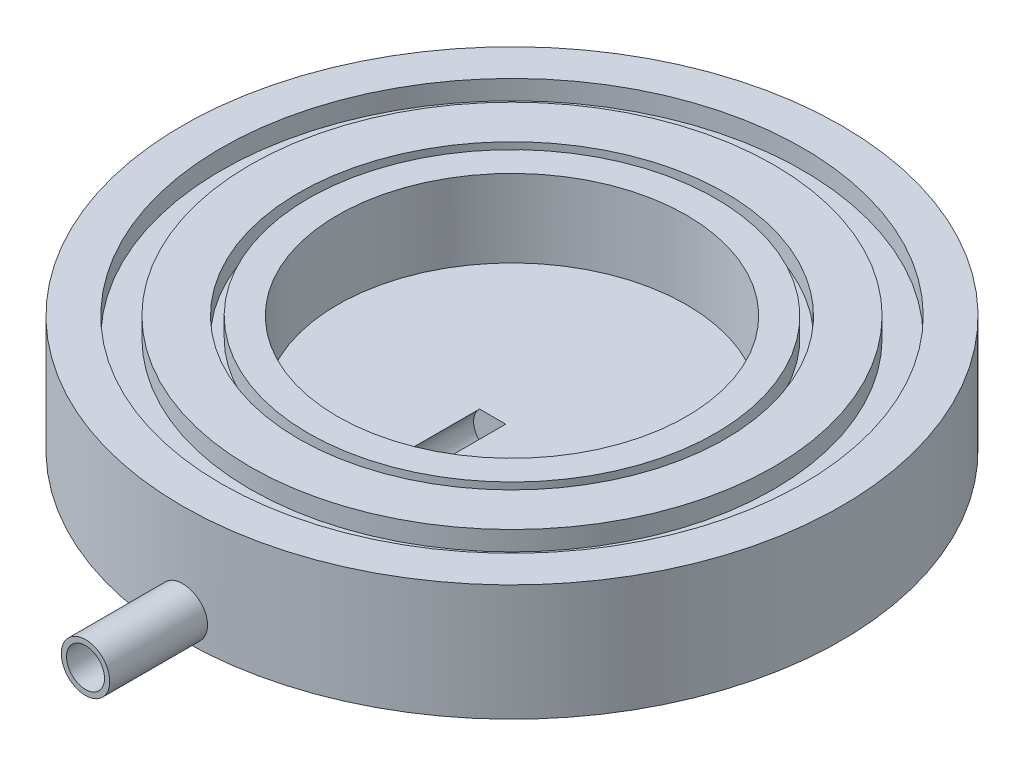
ISO-10303-21;
HEADER;
FILE_DESCRIPTION(('STEP AP214'),'2;1');
FILE_NAME('part.step','',(''),(''),'','','');
FILE_SCHEMA(('AUTOMOTIVE_DESIGN { 1 0 10303 214 1 1 1 1 }'));
ENDSEC;
DATA;
#1=APPLICATION_CONTEXT('core data for automotive mechanical design processes');
#2=APPLICATION_PROTOCOL_DEFINITION('international standard','automotive_design',2000,#1);
#3=PRODUCT_CONTEXT('',#1,'mechanical');
#4=PRODUCT('Part','Part','',(#3));
#5=PRODUCT_RELATED_PRODUCT_CATEGORY('part','',(#4));
#6=PRODUCT_DEFINITION_FORMATION('','',#4);
#7=PRODUCT_DEFINITION_CONTEXT('part definition',#1,'design');
#8=PRODUCT_DEFINITION('design','',#6,#7);
#9=PRODUCT_DEFINITION_SHAPE('','',#8);
#10=(LENGTH_UNIT() NAMED_UNIT(*) SI_UNIT(.MILLI.,.METRE.));
#11=(NAMED_UNIT(*) PLANE_ANGLE_UNIT() SI_UNIT($,.RADIAN.));
#12=(NAMED_UNIT(*) SI_UNIT($,.STERADIAN.) SOLID_ANGLE_UNIT());
#13=UNCERTAINTY_MEASURE_WITH_UNIT(LENGTH_MEASURE(1.E-05),#10,'distance_accuracy_value','');
#14=(GEOMETRIC_REPRESENTATION_CONTEXT(3) GLOBAL_UNCERTAINTY_ASSIGNED_CONTEXT((#13)) GLOBAL_UNIT_ASSIGNED_CONTEXT((#10,
#11,#12)) REPRESENTATION_CONTEXT('',''));
#15=CARTESIAN_POINT('',(0.,0.,0.));
#16=DIRECTION('',(0.,0.,1.));
#17=DIRECTION('',(1.,0.,0.));
#18=AXIS2_PLACEMENT_3D('',#15,#16,#17);
#19=CARTESIAN_POINT('',(0.,6.,0.));
#20=DIRECTION('',(0.,-1.,0.));
#21=DIRECTION('',(0.,0.,-1.));
#22=AXIS2_PLACEMENT_3D('',#19,#20,#21);
#23=CYLINDRICAL_SURFACE('',#22,17.);
#24=CARTESIAN_POINT('',(0.,6.,0.));
#25=DIRECTION('',(0.,1.,0.));
#26=DIRECTION('',(0.,0.,1.));
#27=AXIS2_PLACEMENT_3D('',#24,#25,#26);
#28=CIRCLE('',#27,17.);
#29=CARTESIAN_POINT('',(0.,6.,17.));
#30=VERTEX_POINT('',#29);
#31=EDGE_CURVE('E106',#30,#30,#28,.T.);
#32=ORIENTED_EDGE('',*,*,#31,.F.);
#33=EDGE_LOOP('',(#32));
#34=FACE_BOUND('',#33,.T.);
#35=CARTESIAN_POINT('',(0.,0.,0.));
#36=DIRECTION('',(0.,1.,0.));
#37=DIRECTION('',(0.,0.,1.));
#38=AXIS2_PLACEMENT_3D('',#35,#36,#37);
#39=CIRCLE('',#38,17.);
#40=CARTESIAN_POINT('',(0.,0.,17.));
#41=VERTEX_POINT('',#40);
#42=EDGE_CURVE('E165',#41,#41,#39,.T.);
#43=ORIENTED_EDGE('',*,*,#42,.T.);
#44=EDGE_LOOP('',(#43));
#45=FACE_BOUND('',#44,.T.);
#46=CARTESIAN_POINT('',(-1.25,1.28902222178879,16.953981833186));
#47=CARTESIAN_POINT('',(-1.24999692557943,1.21891107328766,16.9539824459439));
#48=CARTESIAN_POINT('',(-1.24408147886689,1.14875150469129,16.9544214169413));
#49=CARTESIAN_POINT('',(-1.22056959678384,1.01037159336078,16.9561299662255));
#50=CARTESIAN_POINT('',(-1.20295974332161,0.94215357222219,16.9574004986165));
#51=CARTESIAN_POINT('',(-1.1565693287629,0.809681114872543,16.9606274888907));
#52=CARTESIAN_POINT('',(-1.12779487966738,0.745424532258821,16.9625835714164));
#53=CARTESIAN_POINT('',(-1.05990246372912,0.622669361280807,16.9669607865146));
#54=CARTESIAN_POINT('',(-1.02078678762389,0.564169501648953,16.9693818160618));
#55=CARTESIAN_POINT('',(-0.933236050581498,0.454453651005182,16.9744216645957));
#56=CARTESIAN_POINT('',(-0.884784387666699,0.403250922791576,16.9770408308078));
#57=CARTESIAN_POINT('',(-0.77997183433928,0.309696547084535,16.9821786349764));
#58=CARTESIAN_POINT('',(-0.723610606541612,0.267345277344849,16.9846972686387));
#59=CARTESIAN_POINT('',(-0.604501502849747,0.192653314335197,16.9893533909041));
#60=CARTESIAN_POINT('',(-0.541746546947161,0.160323882262436,16.9914904496098));
#61=CARTESIAN_POINT('',(-0.411680884364776,0.106665362228291,16.995138923341));
#62=CARTESIAN_POINT('',(-0.34437024174164,0.0853361196316241,16.9966503471614));
#63=CARTESIAN_POINT('',(-0.207234151380024,0.0543210269826913,16.9988748380483));
#64=CARTESIAN_POINT('',(-0.137413515867867,0.0446140049775358,16.9995893566571));
#65=CARTESIAN_POINT('',(0.00286947837938254,0.0370534834948896,17.0001444349776));
#66=CARTESIAN_POINT('',(0.0733318275417687,0.0391998074843859,16.9999850077051));
#67=CARTESIAN_POINT('',(0.212754602923519,0.0552676648202849,16.9988113616705));
#68=CARTESIAN_POINT('',(0.281717669127896,0.0691664281904222,16.9977987958507));
#69=CARTESIAN_POINT('',(0.416329354257501,0.108309259207814,16.9950347187855));
#70=CARTESIAN_POINT('',(0.481977947625944,0.133553414320712,16.9932832018434));
#71=CARTESIAN_POINT('',(0.608169949666979,0.194696023768112,16.9892355037306));
#72=CARTESIAN_POINT('',(0.668708370137764,0.230604737138619,16.9869387985317));
#73=CARTESIAN_POINT('',(0.782907106281559,0.312049692553388,16.9820590158151));
#74=CARTESIAN_POINT('',(0.836567313828863,0.357586085915253,16.9794759337968));
#75=CARTESIAN_POINT('',(0.935619422857147,0.457122258845775,16.9743066862842));
#76=CARTESIAN_POINT('',(0.980991456077992,0.511141812773049,16.9717205279598));
#77=CARTESIAN_POINT('',(1.06202593177972,0.626041793349669,16.9668427880922));
#78=CARTESIAN_POINT('',(1.09768836858724,0.686922224007822,16.9645512067212));
#79=CARTESIAN_POINT('',(1.15829023695906,0.813829069430998,16.9605215350158));
#80=CARTESIAN_POINT('',(1.1832287358139,0.879855931214736,16.9587834928288));
#81=CARTESIAN_POINT('',(1.2216606099829,1.01517516367991,16.9560584976914));
#82=CARTESIAN_POINT('',(1.23515417208654,1.08446748104732,16.955071532483));
#83=CARTESIAN_POINT('',(1.25028819040206,1.22417709322212,16.9539623118694));
#84=CARTESIAN_POINT('',(1.25195630832877,1.29459137624736,16.9538380384963));
#85=CARTESIAN_POINT('',(1.24346445207439,1.43469865751284,16.9544629398325));
#86=CARTESIAN_POINT('',(1.23330456347258,1.50439166096808,16.9552121082222));
#87=CARTESIAN_POINT('',(1.2014681149111,1.64099924676947,16.9574976332766));
#88=CARTESIAN_POINT('',(1.17980437827177,1.70791683350052,16.9590331133732));
#89=CARTESIAN_POINT('',(1.12558819868433,1.8371669402595,16.9627175058434));
#90=CARTESIAN_POINT('',(1.093035619262,1.8994994028083,16.9648664259054));
#91=CARTESIAN_POINT('',(1.01789545578617,2.01793669867594,16.9695404494383));
#92=CARTESIAN_POINT('',(0.975289387016896,2.07402977711389,16.9720662426589));
#93=CARTESIAN_POINT('',(0.881278475070118,2.17827742166938,16.9772070305212));
#94=CARTESIAN_POINT('',(0.829873513620272,2.22643188106106,16.9798220263615));
#95=CARTESIAN_POINT('',(0.719604721600593,2.31352928256047,16.9848525221661));
#96=CARTESIAN_POINT('',(0.660726703661309,2.35245428877407,16.9872676278468));
#97=CARTESIAN_POINT('',(0.53725414463098,2.41986495234523,16.9916205512693));
#98=CARTESIAN_POINT('',(0.472659649697932,2.44835069398566,16.9935583728645));
#99=CARTESIAN_POINT('',(0.339652849576902,2.49404321795917,16.9967365422323));
#100=CARTESIAN_POINT('',(0.271244416979004,2.51126122285975,16.997977583816));
#101=CARTESIAN_POINT('',(0.132498128775221,2.53396622097393,16.9996251545688));
#102=CARTESIAN_POINT('',(0.0621603008194301,2.53945338221295,17.0000316956906));
#103=CARTESIAN_POINT('',(-0.0782709964115803,2.53853915532199,16.9999644877124));
#104=CARTESIAN_POINT('',(-0.148364650740278,2.53216577726998,16.9994928126234));
#105=CARTESIAN_POINT('',(-0.286483454965149,2.50776963159518,16.9977262960799));
#106=CARTESIAN_POINT('',(-0.354508601588181,2.48974684553976,16.9964314533231));
#107=CARTESIAN_POINT('',(-0.486562361031647,2.4425702321723,16.9931640081651));
#108=CARTESIAN_POINT('',(-0.550591089402136,2.41341672686086,16.9911914253706));
#109=CARTESIAN_POINT('',(-0.672849362079839,2.34480969574453,16.9867895838645));
#110=CARTESIAN_POINT('',(-0.73107902762517,2.305356385335,16.9843603347032));
#111=CARTESIAN_POINT('',(-0.840229174830547,2.21716499520072,16.9793112950387));
#112=CARTESIAN_POINT('',(-0.891133024700776,2.16840635520631,16.976691090694));
#113=CARTESIAN_POINT('',(-0.984052685816107,2.06302205799333,16.9715589165542));
#114=CARTESIAN_POINT('',(-1.02606633043069,2.00639448859716,16.9690469732619));
#115=CARTESIAN_POINT('',(-1.10005662020513,1.88679299546481,16.9644114596226));
#116=CARTESIAN_POINT('',(-1.13201761308658,1.82380937457393,16.9622884970546));
#117=CARTESIAN_POINT('',(-1.18487080340908,1.69339857157662,16.9586788843558));
#118=CARTESIAN_POINT('',(-1.20577584741143,1.62597664952791,16.9571914961015));
#119=CARTESIAN_POINT('',(-1.23054404650428,1.51329484493451,16.9554076662488));
#120=CARTESIAN_POINT('',(-1.23783046484604,1.46876160446744,16.9548754018856));
#121=CARTESIAN_POINT('',(-1.24755942517235,1.37916632247737,16.9541622887026));
#122=CARTESIAN_POINT('',(-1.25000197687838,1.33410428201584,16.9539814391774));
#123=CARTESIAN_POINT('',(-1.25,1.28902222178879,16.953981833186));
#124=B_SPLINE_CURVE_WITH_KNOTS('',3,(#46,#47,#48,#49,#50,#51,#52,#53,#54,#55,#56,#57,#58,#59,
#60,#61,#62,#63,#64,#65,#66,#67,#68,#69,#70,#71,#72,#73,#74,#75,#76,#77,#78,#79,#80,#81,#82,#83,
#84,#85,#86,#87,#88,#89,#90,#91,#92,#93,#94,#95,#96,#97,#98,#99,#100,#101,#102,#103,#104,#105,
#106,#107,#108,#109,#110,#111,#112,#113,#114,#115,#116,#117,#118,#119,#120,#121,#122,#123),
.UNSPECIFIED.,.T.,.F.,(4,2,2,2,2,2,2,2,2,2,2,2,2,2,2,2,2,2,2,2,2,2,2,2,2,2,2,2,2,2,2,2,2,2,2,2,
2,2,4),(0.,0.210168855610384,0.420579275311207,0.630874669053931,0.841123518174783,
1.05174975741825,1.26238498372439,1.47325604282224,1.6841241375171,1.89460751095823,
2.10508774965884,2.3151611215402,2.52523611297935,2.7355138494702,2.94579489112785,
3.15657358259459,3.36735239721981,3.57814954052707,3.78894324340928,3.9992437009626,
4.20954263693657,4.41960764361068,4.62967528321187,4.84013221258036,5.05059197107628,
5.26145743081057,5.47232118805581,5.68297460590195,5.89362500645725,6.10377856217503,
6.31393245041587,6.52408025957501,6.73422367435593,6.94483689552288,7.15550138623813,
7.36649228241753,7.57723747413227,7.71237809334555,7.84751844133634),.UNSPECIFIED.);
#125=CARTESIAN_POINT('',(-1.25,1.28902222178879,16.953981833186));
#126=VERTEX_POINT('',#125);
#127=EDGE_CURVE('E50',#126,#126,#124,.T.);
#128=ORIENTED_EDGE('',*,*,#127,.F.);
#129=EDGE_LOOP('',(#128));
#130=FACE_BOUND('',#129,.T.);
#131=ADVANCED_FACE('F41',(#34,#45,#130),#23,.T.);
#132=CARTESIAN_POINT('',(0.,2.,0.));
#133=DIRECTION('',(0.,1.,0.));
#134=DIRECTION('',(0.,0.,1.));
#135=AXIS2_PLACEMENT_3D('',#132,#133,#134);
#136=CYLINDRICAL_SURFACE('',#135,9.);
#137=CARTESIAN_POINT('',(0.,6.,0.));
#138=DIRECTION('',(0.,1.,0.));
#139=DIRECTION('',(0.,0.,1.));
#140=AXIS2_PLACEMENT_3D('',#137,#138,#139);
#141=CIRCLE('',#140,9.);
#142=CARTESIAN_POINT('',(0.,6.,9.));
#143=VERTEX_POINT('',#142);
#144=EDGE_CURVE('E88',#143,#143,#141,.T.);
#145=ORIENTED_EDGE('',*,*,#144,.T.);
#146=EDGE_LOOP('',(#145));
#147=FACE_BOUND('',#146,.T.);
#148=CARTESIAN_POINT('',(0.,2.,0.));
#149=DIRECTION('',(0.,1.,0.));
#150=DIRECTION('',(0.,0.,1.));
#151=AXIS2_PLACEMENT_3D('',#148,#149,#150);
#152=CIRCLE('',#151,9.);
#153=CARTESIAN_POINT('',(0.67636058871575,2.,8.97454936774165));
#154=VERTEX_POINT('',#153);
#155=CARTESIAN_POINT('',(-0.67636058871575,2.,8.97454936774165));
#156=VERTEX_POINT('',#155);
#157=EDGE_CURVE('E80',#154,#156,#152,.T.);
#158=ORIENTED_EDGE('',*,*,#157,.F.);
#159=CARTESIAN_POINT('',(0.67636058871575,2.,8.97454936774165));
#160=CARTESIAN_POINT('',(0.636452360157026,2.03802784530714,8.97756660955961));
#161=CARTESIAN_POINT('',(0.593287556880188,2.0726207090355,8.98054341775859));
#162=CARTESIAN_POINT('',(0.501793965068544,2.13410684526042,8.98611449384327));
#163=CARTESIAN_POINT('',(0.453467934914595,2.16100420256636,8.98870896431956));
#164=CARTESIAN_POINT('',(0.352925251094529,2.20632563649592,8.99321890899581));
#165=CARTESIAN_POINT('',(0.300706251137024,2.2247445544038,8.99513396964609));
#166=CARTESIAN_POINT('',(0.193909438113326,2.25255435070712,8.99806906172462));
#167=CARTESIAN_POINT('',(0.139332346049632,2.26194796852004,8.99908936472729));
#168=CARTESIAN_POINT('',(0.0295806437400975,2.27141758199304,9.00011807459973));
#169=CARTESIAN_POINT('',(-0.0255908151328428,2.27152969155946,9.00013040344658));
#170=CARTESIAN_POINT('',(-0.135183795753101,2.26252183601315,8.99915156902841));
#171=CARTESIAN_POINT('',(-0.189605088678442,2.25339911452837,8.99816010615599));
#172=CARTESIAN_POINT('',(-0.296035647151673,2.22621448799631,8.99528739765812));
#173=CARTESIAN_POINT('',(-0.348048837103815,2.20816773035867,8.99340766000453));
#174=CARTESIAN_POINT('',(-0.448283644464139,2.16366231251825,8.98896856199127));
#175=CARTESIAN_POINT('',(-0.496508593515021,2.13721114942053,8.98640980767878));
#176=CARTESIAN_POINT('',(-0.566052026392539,2.09112165063418,8.98221370549356));
#177=CARTESIAN_POINT('',(-0.589248093964708,2.07423677535245,8.98071778165133));
#178=CARTESIAN_POINT('',(-0.634032518989167,2.03853785146833,8.97766701640398));
#179=CARTESIAN_POINT('',(-0.655623686218339,2.01972731840677,8.97611228551992));
#180=CARTESIAN_POINT('',(-0.676360588715802,2.00000000000006,8.97454936774181));
#181=B_SPLINE_CURVE_WITH_KNOTS('',3,(#159,#160,#161,#162,#163,#164,#165,#166,#167,#168,#169,
#170,#171,#172,#173,#174,#175,#176,#177,#178,#179,#180),.UNSPECIFIED.,.F.,.F.,(4,2,2,2,2,2,2,2,
2,2,4),(0.,0.165410211048664,0.330732458026356,0.496155162974293,0.661527641875823,
0.826256633979614,0.991034808175359,1.1555342476171,1.31988735625609,1.40598005091254,
1.49191828398093),.UNSPECIFIED.);
#182=EDGE_CURVE('E83',#154,#156,#181,.T.);
#183=ORIENTED_EDGE('',*,*,#182,.T.);
#184=EDGE_LOOP('',(#158,#183));
#185=FACE_BOUND('',#184,.T.);
#186=ADVANCED_FACE('F118',(#147,#185),#136,.F.);
#187=CARTESIAN_POINT('',(0.,2.,0.));
#188=DIRECTION('',(0.,1.,0.));
#189=DIRECTION('',(0.,0.,1.));
#190=AXIS2_PLACEMENT_3D('',#187,#188,#189);
#191=PLANE('',#190);
#192=DIRECTION('',(0.,0.,1.));
#193=VECTOR('',#192,1.);
#194=CARTESIAN_POINT('',(-0.67636058871575,2.,1.));
#195=LINE('',#194,#193);
#196=CARTESIAN_POINT('',(-0.67636058871575,2.,1.));
#197=VERTEX_POINT('',#196);
#198=EDGE_CURVE('E63',#197,#156,#195,.T.);
#199=ORIENTED_EDGE('',*,*,#198,.F.);
#200=DIRECTION('',(1.,0.,0.));
#201=VECTOR('',#200,1.);
#202=CARTESIAN_POINT('',(0.,2.,1.));
#203=LINE('',#202,#201);
#204=CARTESIAN_POINT('',(0.67636058871575,2.,1.));
#205=VERTEX_POINT('',#204);
#206=EDGE_CURVE('E11',#197,#205,#203,.T.);
#207=ORIENTED_EDGE('',*,*,#206,.T.);
#208=DIRECTION('',(0.,0.,1.));
#209=VECTOR('',#208,1.);
#210=CARTESIAN_POINT('',(0.67636058871575,2.,1.));
#211=LINE('',#210,#209);
#212=EDGE_CURVE('E73',#154,#205,#211,.F.);
#213=ORIENTED_EDGE('',*,*,#212,.F.);
#214=ORIENTED_EDGE('',*,*,#157,.T.);
#215=EDGE_LOOP('',(#199,#207,#213,#214));
#216=FACE_BOUND('',#215,.T.);
#217=ADVANCED_FACE('F78',(#216),#191,.T.);
#218=CARTESIAN_POINT('',(0.,6.,0.));
#219=DIRECTION('',(0.,1.,0.));
#220=DIRECTION('',(0.,0.,1.));
#221=AXIS2_PLACEMENT_3D('',#218,#219,#220);
#222=PLANE('',#221);
#223=CARTESIAN_POINT('',(0.,6.,0.));
#224=DIRECTION('',(0.,1.,0.));
#225=DIRECTION('',(0.,0.,1.));
#226=AXIS2_PLACEMENT_3D('',#223,#224,#225);
#227=CIRCLE('',#226,15.);
#228=CARTESIAN_POINT('',(0.,6.,15.));
#229=VERTEX_POINT('',#228);
#230=EDGE_CURVE('E174',#229,#229,#227,.T.);
#231=ORIENTED_EDGE('',*,*,#230,.F.);
#232=EDGE_LOOP('',(#231));
#233=FACE_BOUND('',#232,.T.);
#234=ORIENTED_EDGE('',*,*,#31,.T.);
#235=EDGE_LOOP('',(#234));
#236=FACE_BOUND('',#235,.T.);
#237=ADVANCED_FACE('F117',(#233,#236),#222,.T.);
#238=CARTESIAN_POINT('',(0.,0.,0.));
#239=DIRECTION('',(0.,1.,0.));
#240=DIRECTION('',(0.,0.,1.));
#241=AXIS2_PLACEMENT_3D('',#238,#239,#240);
#242=PLANE('',#241);
#243=ORIENTED_EDGE('',*,*,#42,.F.);
#244=EDGE_LOOP('',(#243));
#245=FACE_BOUND('',#244,.T.);
#246=ADVANCED_FACE('F147',(#245),#242,.F.);
#247=CARTESIAN_POINT('',(0.,5.,0.));
#248=DIRECTION('',(0.,1.,0.));
#249=DIRECTION('',(0.,0.,1.));
#250=AXIS2_PLACEMENT_3D('',#247,#248,#249);
#251=CYLINDRICAL_SURFACE('',#250,15.);
#252=CARTESIAN_POINT('',(0.,5.,0.));
#253=DIRECTION('',(0.,1.,0.));
#254=DIRECTION('',(0.,0.,1.));
#255=AXIS2_PLACEMENT_3D('',#252,#253,#254);
#256=CIRCLE('',#255,15.);
#257=CARTESIAN_POINT('',(0.,5.,15.));
#258=VERTEX_POINT('',#257);
#259=EDGE_CURVE('E169',#258,#258,#256,.T.);
#260=ORIENTED_EDGE('',*,*,#259,.F.);
#261=EDGE_LOOP('',(#260));
#262=FACE_BOUND('',#261,.T.);
#263=ORIENTED_EDGE('',*,*,#230,.T.);
#264=EDGE_LOOP('',(#263));
#265=FACE_BOUND('',#264,.T.);
#266=ADVANCED_FACE('F143',(#262,#265),#251,.F.);
#267=CARTESIAN_POINT('',(0.,5.,0.));
#268=DIRECTION('',(0.,1.,0.));
#269=DIRECTION('',(0.,0.,1.));
#270=AXIS2_PLACEMENT_3D('',#267,#268,#269);
#271=PLANE('',#270);
#272=CARTESIAN_POINT('',(0.,5.,0.));
#273=DIRECTION('',(0.,1.,0.));
#274=DIRECTION('',(0.,0.,1.));
#275=AXIS2_PLACEMENT_3D('',#272,#273,#274);
#276=CIRCLE('',#275,13.5);
#277=CARTESIAN_POINT('',(0.,5.,13.5));
#278=VERTEX_POINT('',#277);
#279=EDGE_CURVE('E179',#278,#278,#276,.T.);
#280=ORIENTED_EDGE('',*,*,#279,.F.);
#281=EDGE_LOOP('',(#280));
#282=FACE_BOUND('',#281,.T.);
#283=ORIENTED_EDGE('',*,*,#259,.T.);
#284=EDGE_LOOP('',(#283));
#285=FACE_BOUND('',#284,.T.);
#286=ADVANCED_FACE('F139',(#282,#285),#271,.T.);
#287=CARTESIAN_POINT('',(0.,5.,0.));
#288=DIRECTION('',(0.,1.,0.));
#289=DIRECTION('',(0.,0.,1.));
#290=AXIS2_PLACEMENT_3D('',#287,#288,#289);
#291=CYLINDRICAL_SURFACE('',#290,13.5);
#292=ORIENTED_EDGE('',*,*,#279,.T.);
#293=EDGE_LOOP('',(#292));
#294=FACE_BOUND('',#293,.T.);
#295=CARTESIAN_POINT('',(0.,6.,0.));
#296=DIRECTION('',(0.,1.,0.));
#297=DIRECTION('',(0.,0.,1.));
#298=AXIS2_PLACEMENT_3D('',#295,#296,#297);
#299=CIRCLE('',#298,13.5);
#300=CARTESIAN_POINT('',(0.,6.,13.5));
#301=VERTEX_POINT('',#300);
#302=EDGE_CURVE('E181',#301,#301,#299,.T.);
#303=ORIENTED_EDGE('',*,*,#302,.F.);
#304=EDGE_LOOP('',(#303));
#305=FACE_BOUND('',#304,.T.);
#306=ADVANCED_FACE('F136',(#294,#305),#291,.T.);
#307=CARTESIAN_POINT('',(0.,6.,0.));
#308=DIRECTION('',(0.,1.,0.));
#309=DIRECTION('',(0.,0.,1.));
#310=AXIS2_PLACEMENT_3D('',#307,#308,#309);
#311=CIRCLE('',#310,11.);
#312=CARTESIAN_POINT('',(0.,6.,11.));
#313=VERTEX_POINT('',#312);
#314=EDGE_CURVE('E189',#313,#313,#311,.T.);
#315=ORIENTED_EDGE('',*,*,#314,.F.);
#316=EDGE_LOOP('',(#315));
#317=FACE_BOUND('',#316,.T.);
#318=ORIENTED_EDGE('',*,*,#302,.T.);
#319=EDGE_LOOP('',(#318));
#320=FACE_BOUND('',#319,.T.);
#321=ADVANCED_FACE('F134',(#317,#320),#222,.T.);
#322=CARTESIAN_POINT('',(0.,5.,0.));
#323=DIRECTION('',(0.,1.,0.));
#324=DIRECTION('',(0.,0.,1.));
#325=AXIS2_PLACEMENT_3D('',#322,#323,#324);
#326=CYLINDRICAL_SURFACE('',#325,11.);
#327=CARTESIAN_POINT('',(0.,5.,0.));
#328=DIRECTION('',(0.,1.,0.));
#329=DIRECTION('',(0.,0.,1.));
#330=AXIS2_PLACEMENT_3D('',#327,#328,#329);
#331=CIRCLE('',#330,11.);
#332=CARTESIAN_POINT('',(0.,5.,11.));
#333=VERTEX_POINT('',#332);
#334=EDGE_CURVE('E185',#333,#333,#331,.T.);
#335=ORIENTED_EDGE('',*,*,#334,.F.);
#336=EDGE_LOOP('',(#335));
#337=FACE_BOUND('',#336,.T.);
#338=ORIENTED_EDGE('',*,*,#314,.T.);
#339=EDGE_LOOP('',(#338));
#340=FACE_BOUND('',#339,.T.);
#341=ADVANCED_FACE('F130',(#337,#340),#326,.F.);
#342=CARTESIAN_POINT('',(0.,5.,0.));
#343=DIRECTION('',(0.,1.,0.));
#344=DIRECTION('',(0.,0.,1.));
#345=AXIS2_PLACEMENT_3D('',#342,#343,#344);
#346=PLANE('',#345);
#347=CARTESIAN_POINT('',(0.,5.,0.));
#348=DIRECTION('',(0.,1.,0.));
#349=DIRECTION('',(0.,0.,1.));
#350=AXIS2_PLACEMENT_3D('',#347,#348,#349);
#351=CIRCLE('',#350,10.5);
#352=CARTESIAN_POINT('',(0.,5.,10.5));
#353=VERTEX_POINT('',#352);
#354=EDGE_CURVE('E193',#353,#353,#351,.T.);
#355=ORIENTED_EDGE('',*,*,#354,.F.);
#356=EDGE_LOOP('',(#355));
#357=FACE_BOUND('',#356,.T.);
#358=ORIENTED_EDGE('',*,*,#334,.T.);
#359=EDGE_LOOP('',(#358));
#360=FACE_BOUND('',#359,.T.);
#361=ADVANCED_FACE('F126',(#357,#360),#346,.T.);
#362=CARTESIAN_POINT('',(0.,5.,0.));
#363=DIRECTION('',(0.,1.,0.));
#364=DIRECTION('',(0.,0.,1.));
#365=AXIS2_PLACEMENT_3D('',#362,#363,#364);
#366=CYLINDRICAL_SURFACE('',#365,10.5);
#367=ORIENTED_EDGE('',*,*,#354,.T.);
#368=EDGE_LOOP('',(#367));
#369=FACE_BOUND('',#368,.T.);
#370=CARTESIAN_POINT('',(0.,6.,0.));
#371=DIRECTION('',(0.,1.,0.));
#372=DIRECTION('',(0.,0.,1.));
#373=AXIS2_PLACEMENT_3D('',#370,#371,#372);
#374=CIRCLE('',#373,10.5);
#375=CARTESIAN_POINT('',(0.,6.,10.5));
#376=VERTEX_POINT('',#375);
#377=EDGE_CURVE('E197',#376,#376,#374,.T.);
#378=ORIENTED_EDGE('',*,*,#377,.F.);
#379=EDGE_LOOP('',(#378));
#380=FACE_BOUND('',#379,.T.);
#381=ADVANCED_FACE('F123',(#369,#380),#366,.T.);
#382=ORIENTED_EDGE('',*,*,#144,.F.);
#383=EDGE_LOOP('',(#382));
#384=FACE_BOUND('',#383,.T.);
#385=ORIENTED_EDGE('',*,*,#377,.T.);
#386=EDGE_LOOP('',(#385));
#387=FACE_BOUND('',#386,.T.);
#388=ADVANCED_FACE('F114',(#384,#387),#222,.T.);
#389=CARTESIAN_POINT('',(0.,1.28902222178879,22.));
#390=DIRECTION('',(0.,0.,-1.));
#391=DIRECTION('',(-1.,0.,0.));
#392=AXIS2_PLACEMENT_3D('',#389,#390,#391);
#393=CYLINDRICAL_SURFACE('',#392,1.25);
#394=CARTESIAN_POINT('',(0.,1.28902222178879,22.));
#395=DIRECTION('',(0.,0.,1.));
#396=DIRECTION('',(1.,0.,0.));
#397=AXIS2_PLACEMENT_3D('',#394,#395,#396);
#398=CIRCLE('',#397,1.25);
#399=CARTESIAN_POINT('',(1.25,1.28902222178879,22.));
#400=VERTEX_POINT('',#399);
#401=EDGE_CURVE('E82',#400,#400,#398,.T.);
#402=ORIENTED_EDGE('',*,*,#401,.F.);
#403=EDGE_LOOP('',(#402));
#404=FACE_BOUND('',#403,.T.);
#405=ORIENTED_EDGE('',*,*,#127,.T.);
#406=EDGE_LOOP('',(#405));
#407=FACE_BOUND('',#406,.T.);
#408=ADVANCED_FACE('F108',(#404,#407),#393,.T.);
#409=CARTESIAN_POINT('',(0.,1.28902222178879,22.));
#410=DIRECTION('',(0.,0.,1.));
#411=DIRECTION('',(1.,0.,0.));
#412=AXIS2_PLACEMENT_3D('',#409,#410,#411);
#413=PLANE('',#412);
#414=CARTESIAN_POINT('',(0.,1.28902222178879,22.));
#415=DIRECTION('',(0.,0.,1.));
#416=DIRECTION('',(1.,0.,0.));
#417=AXIS2_PLACEMENT_3D('',#414,#415,#416);
#418=CIRCLE('',#417,0.981301710524373);
#419=CARTESIAN_POINT('',(0.981301710524373,1.28902222178879,22.));
#420=VERTEX_POINT('',#419);
#421=EDGE_CURVE('E75',#420,#420,#418,.T.);
#422=ORIENTED_EDGE('',*,*,#421,.F.);
#423=EDGE_LOOP('',(#422));
#424=FACE_BOUND('',#423,.T.);
#425=ORIENTED_EDGE('',*,*,#401,.T.);
#426=EDGE_LOOP('',(#425));
#427=FACE_BOUND('',#426,.T.);
#428=ADVANCED_FACE('F113',(#424,#427),#413,.T.);
#429=CARTESIAN_POINT('',(0.,1.28902222178879,1.));
#430=DIRECTION('',(0.,0.,1.));
#431=DIRECTION('',(1.,0.,0.));
#432=AXIS2_PLACEMENT_3D('',#429,#430,#431);
#433=CYLINDRICAL_SURFACE('',#432,0.981301710524373);
#434=ORIENTED_EDGE('',*,*,#198,.T.);
#435=ORIENTED_EDGE('',*,*,#182,.F.);
#436=ORIENTED_EDGE('',*,*,#212,.T.);
#437=CARTESIAN_POINT('',(0.,1.28902222178879,1.));
#438=DIRECTION('',(0.,0.,1.));
#439=DIRECTION('',(1.,0.,0.));
#440=AXIS2_PLACEMENT_3D('',#437,#438,#439);
#441=CIRCLE('',#440,0.981301710524373);
#442=EDGE_CURVE('E56',#197,#205,#441,.T.);
#443=ORIENTED_EDGE('',*,*,#442,.F.);
#444=EDGE_LOOP('',(#434,#435,#436,#443));
#445=FACE_BOUND('',#444,.T.);
#446=ORIENTED_EDGE('',*,*,#421,.T.);
#447=EDGE_LOOP('',(#446));
#448=FACE_BOUND('',#447,.T.);
#449=ADVANCED_FACE('F71',(#445,#448),#433,.F.);
#450=CARTESIAN_POINT('',(0.,1.28902222178879,1.));
#451=DIRECTION('',(0.,0.,1.));
#452=DIRECTION('',(1.,0.,0.));
#453=AXIS2_PLACEMENT_3D('',#450,#451,#452);
#454=PLANE('',#453);
#455=ORIENTED_EDGE('',*,*,#442,.T.);
#456=ORIENTED_EDGE('',*,*,#206,.F.);
#457=EDGE_LOOP('',(#455,#456));
#458=FACE_BOUND('',#457,.T.);
#459=ADVANCED_FACE('F68',(#458),#454,.T.);
#460=CLOSED_SHELL('',(#131,#186,#217,#237,#246,#266,#286,#306,#321,#341,#361,#381,#388,#408,
#428,#449,#459));
#461=MANIFOLD_SOLID_BREP('B2',#460);
#462=ADVANCED_BREP_SHAPE_REPRESENTATION('',(#18,#461),#14);
#463=SHAPE_DEFINITION_REPRESENTATION(#9,#462);
ENDSEC;
END-ISO-10303-21;
